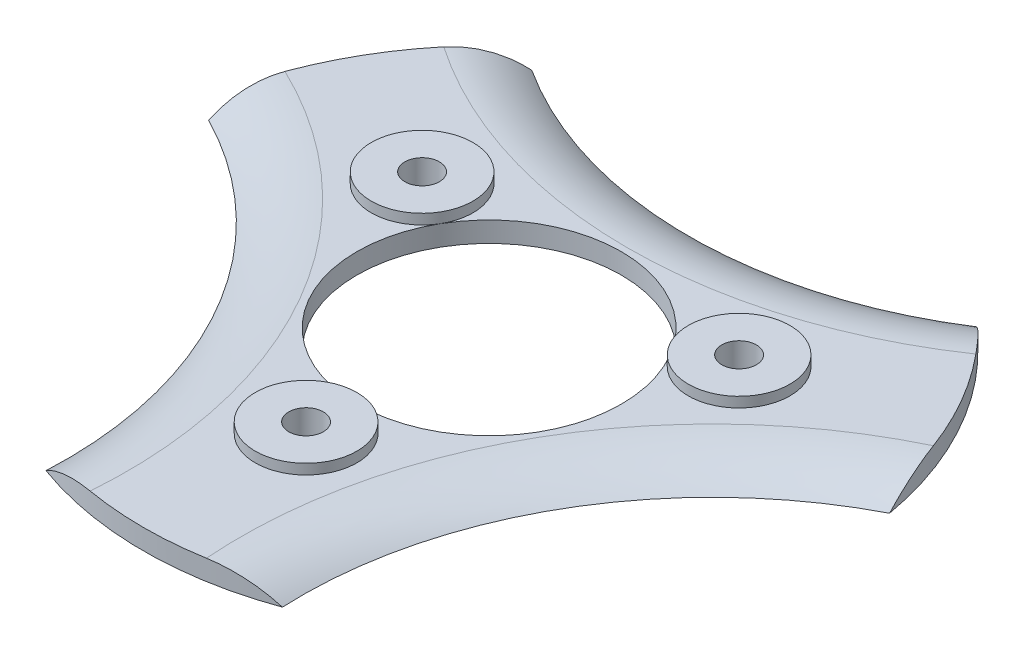
ISO-10303-21;
HEADER;
FILE_DESCRIPTION(('STEP AP214'),'2;1');
FILE_NAME('part.step','',(''),(''),'','','');
FILE_SCHEMA(('AUTOMOTIVE_DESIGN { 1 0 10303 214 1 1 1 1 }'));
ENDSEC;
DATA;
#1=APPLICATION_CONTEXT('core data for automotive mechanical design processes');
#2=APPLICATION_PROTOCOL_DEFINITION('international standard','automotive_design',2000,#1);
#3=PRODUCT_CONTEXT('',#1,'mechanical');
#4=PRODUCT('Part','Part','',(#3));
#5=PRODUCT_RELATED_PRODUCT_CATEGORY('part','',(#4));
#6=PRODUCT_DEFINITION_FORMATION('','',#4);
#7=PRODUCT_DEFINITION_CONTEXT('part definition',#1,'design');
#8=PRODUCT_DEFINITION('design','',#6,#7);
#9=PRODUCT_DEFINITION_SHAPE('','',#8);
#10=(LENGTH_UNIT() NAMED_UNIT(*) SI_UNIT(.MILLI.,.METRE.));
#11=(NAMED_UNIT(*) PLANE_ANGLE_UNIT() SI_UNIT($,.RADIAN.));
#12=(NAMED_UNIT(*) SI_UNIT($,.STERADIAN.) SOLID_ANGLE_UNIT());
#13=UNCERTAINTY_MEASURE_WITH_UNIT(LENGTH_MEASURE(1.E-05),#10,'distance_accuracy_value','');
#14=(GEOMETRIC_REPRESENTATION_CONTEXT(3) GLOBAL_UNCERTAINTY_ASSIGNED_CONTEXT((#13)) GLOBAL_UNIT_ASSIGNED_CONTEXT((#10,
#11,#12)) REPRESENTATION_CONTEXT('',''));
#15=CARTESIAN_POINT('',(0.,0.,0.));
#16=DIRECTION('',(0.,0.,1.));
#17=DIRECTION('',(1.,0.,0.));
#18=AXIS2_PLACEMENT_3D('',#15,#16,#17);
#19=CARTESIAN_POINT('',(0.,2.,0.));
#20=DIRECTION('',(0.,1.,0.));
#21=DIRECTION('',(0.,0.,1.));
#22=AXIS2_PLACEMENT_3D('',#19,#20,#21);
#23=PLANE('',#22);
#24=CARTESIAN_POINT('',(0.,2.,0.));
#25=DIRECTION('',(0.,1.,0.));
#26=DIRECTION('',(0.,0.,1.));
#27=AXIS2_PLACEMENT_3D('',#24,#25,#26);
#28=CIRCLE('',#27,34.);
#29=CARTESIAN_POINT('',(31.8834478179355,2.,-11.8087152239769));
#30=VERTEX_POINT('',#29);
#31=CARTESIAN_POINT('',(26.168371278988,2.,-21.707518158579));
#32=VERTEX_POINT('',#31);
#33=EDGE_CURVE('E138',#30,#32,#28,.T.);
#34=ORIENTED_EDGE('',*,*,#33,.T.);
#35=CARTESIAN_POINT('',(5.44703171456717E-13,2.,-60.));
#36=DIRECTION('',(0.,1.,0.));
#37=DIRECTION('',(0.,0.,1.));
#38=AXIS2_PLACEMENT_3D('',#35,#36,#37);
#39=CIRCLE('',#38,46.37992907466);
#40=CARTESIAN_POINT('',(-26.1683712789876,2.,-21.7075181585795));
#41=VERTEX_POINT('',#40);
#42=EDGE_CURVE('E66',#32,#41,#39,.F.);
#43=ORIENTED_EDGE('',*,*,#42,.T.);
#44=CARTESIAN_POINT('',(-31.8834478179355,2.,-11.808715223977));
#45=VERTEX_POINT('',#44);
#46=EDGE_CURVE('E136',#41,#45,#28,.T.);
#47=ORIENTED_EDGE('',*,*,#46,.T.);
#48=CARTESIAN_POINT('',(-51.9615242270665,2.,29.9999999999998));
#49=DIRECTION('',(0.,1.,0.));
#50=DIRECTION('',(0.,0.,1.));
#51=AXIS2_PLACEMENT_3D('',#48,#49,#50);
#52=CIRCLE('',#51,46.37992907466);
#53=CARTESIAN_POINT('',(-5.71507653894791,2.,33.5162333825561));
#54=VERTEX_POINT('',#53);
#55=EDGE_CURVE('E197',#45,#54,#52,.F.);
#56=ORIENTED_EDGE('',*,*,#55,.T.);
#57=CARTESIAN_POINT('',(5.71507653894776,2.,33.5162333825561));
#58=VERTEX_POINT('',#57);
#59=EDGE_CURVE('E132',#54,#58,#28,.T.);
#60=ORIENTED_EDGE('',*,*,#59,.T.);
#61=CARTESIAN_POINT('',(51.9615242270663,2.,30.));
#62=DIRECTION('',(0.,1.,0.));
#63=DIRECTION('',(0.,0.,1.));
#64=AXIS2_PLACEMENT_3D('',#61,#62,#63);
#65=CIRCLE('',#64,46.37992907466);
#66=EDGE_CURVE('E113',#58,#30,#65,.F.);
#67=ORIENTED_EDGE('',*,*,#66,.T.);
#68=EDGE_LOOP('',(#34,#43,#47,#56,#60,#67));
#69=FACE_BOUND('',#68,.T.);
#70=CARTESIAN_POINT('',(0.,2.,0.));
#71=DIRECTION('',(0.,1.,0.));
#72=DIRECTION('',(0.,0.,1.));
#73=AXIS2_PLACEMENT_3D('',#70,#71,#72);
#74=CIRCLE('',#73,13.);
#75=CARTESIAN_POINT('',(-1.17142076009162E-13,2.,13.));
#76=VERTEX_POINT('',#75);
#77=CARTESIAN_POINT('',(11.2583302491977,2.,-6.49999999999995));
#78=VERTEX_POINT('',#77);
#79=EDGE_CURVE('E158',#76,#78,#74,.T.);
#80=ORIENTED_EDGE('',*,*,#79,.F.);
#81=CARTESIAN_POINT('',(-1.62196645003831E-13,2.,17.999991607498));
#82=DIRECTION('',(0.,1.,0.));
#83=DIRECTION('',(0.866025403784443,0.,-0.499999999999992));
#84=AXIS2_PLACEMENT_3D('',#81,#82,#83);
#85=CIRCLE('',#84,5.);
#86=EDGE_CURVE('E234',#76,#76,#85,.T.);
#87=ORIENTED_EDGE('',*,*,#86,.F.);
#88=CARTESIAN_POINT('',(-11.2583229810778,2.,-6.49999580374901));
#89=VERTEX_POINT('',#88);
#90=EDGE_CURVE('E217',#89,#76,#74,.T.);
#91=ORIENTED_EDGE('',*,*,#90,.F.);
#92=CARTESIAN_POINT('',(-15.58845,2.,-8.99999580374901));
#93=DIRECTION('',(0.,1.,0.));
#94=DIRECTION('',(0.,0.,1.));
#95=AXIS2_PLACEMENT_3D('',#92,#93,#94);
#96=CIRCLE('',#95,5.);
#97=EDGE_CURVE('E210',#89,#89,#96,.T.);
#98=ORIENTED_EDGE('',*,*,#97,.F.);
#99=EDGE_CURVE('E207',#78,#89,#74,.T.);
#100=ORIENTED_EDGE('',*,*,#99,.F.);
#101=CARTESIAN_POINT('',(15.58845,2.,-8.99999580374895));
#102=DIRECTION('',(0.,1.,0.));
#103=DIRECTION('',(-0.866025403784436,0.,-0.500000000000004));
#104=AXIS2_PLACEMENT_3D('',#101,#102,#103);
#105=CIRCLE('',#104,5.);
#106=EDGE_CURVE('E220',#78,#78,#105,.T.);
#107=ORIENTED_EDGE('',*,*,#106,.F.);
#108=EDGE_LOOP('',(#80,#87,#91,#98,#100,#107));
#109=FACE_BOUND('',#108,.T.);
#110=ADVANCED_FACE('F38',(#69,#109),#23,.T.);
#111=CARTESIAN_POINT('',(0.,2.,0.));
#112=DIRECTION('',(0.,-1.,0.));
#113=DIRECTION('',(0.,0.,-1.));
#114=AXIS2_PLACEMENT_3D('',#111,#112,#113);
#115=CYLINDRICAL_SURFACE('',#114,34.);
#116=ORIENTED_EDGE('',*,*,#46,.F.);
#117=CARTESIAN_POINT('',(-26.1683712789876,2.,-21.7075181585795));
#118=CARTESIAN_POINT('',(-25.9855270764145,2.00004130304708,-21.9279943079052));
#119=CARTESIAN_POINT('',(-25.7998595180002,1.98780212207409,-22.1460914579261));
#120=CARTESIAN_POINT('',(-25.4245270350654,1.93925790771543,-22.5759637575963));
#121=CARTESIAN_POINT('',(-25.2348633954354,1.90296049898237,-22.7877408880027));
#122=CARTESIAN_POINT('',(-24.8580319053838,1.80804409624142,-23.198146988304));
#123=CARTESIAN_POINT('',(-24.6709273135421,1.75002979170822,-23.3969746305963));
#124=CARTESIAN_POINT('',(-24.2959126585912,1.61231560168584,-23.7861641283764));
#125=CARTESIAN_POINT('',(-24.1080026191755,1.53261634984223,-23.9765262310426));
#126=CARTESIAN_POINT('',(-23.745698908433,1.35846597696961,-24.3352069978632));
#127=CARTESIAN_POINT('',(-23.5712552915652,1.26538708925383,-24.5041442946914));
#128=CARTESIAN_POINT('',(-23.2242702680254,1.06180143302202,-24.8332531600146));
#129=CARTESIAN_POINT('',(-23.0517289314906,0.951294024198379,-24.9934244061618));
#130=CARTESIAN_POINT('',(-22.7055403539784,0.710645503192991,-25.3083880694313));
#131=CARTESIAN_POINT('',(-22.5319731336187,0.580082934869169,-25.462946211658));
#132=CARTESIAN_POINT('',(-22.189527740197,0.302313453526672,-25.7619243059814));
#133=CARTESIAN_POINT('',(-22.0206490785681,0.155108282905113,-25.9063453168236));
#134=CARTESIAN_POINT('',(-21.8547787293421,0.,-26.0455110660455));
#135=B_SPLINE_CURVE_WITH_KNOTS('',3,(#117,#118,#119,#120,#121,#122,#123,#124,#125,#126,#127,
#128,#129,#130,#131,#132,#133,#134),.UNSPECIFIED.,.F.,.F.,(4,2,2,2,2,2,2,2,4),(0.,
0.858962445971918,1.71765279539769,2.55402460160269,3.39037197120738,4.16982886817323,
4.9493144083322,5.74826944816565,6.54714091873224),.UNSPECIFIED.);
#136=CARTESIAN_POINT('',(-21.8547787293421,0.,-26.0455110660455));
#137=VERTEX_POINT('',#136);
#138=EDGE_CURVE('E187',#41,#137,#135,.T.);
#139=ORIENTED_EDGE('',*,*,#138,.T.);
#140=CARTESIAN_POINT('',(0.,0.,0.));
#141=DIRECTION('',(0.,1.,0.));
#142=DIRECTION('',(0.,0.,1.));
#143=AXIS2_PLACEMENT_3D('',#140,#141,#142);
#144=CIRCLE('',#143,34.);
#145=CARTESIAN_POINT('',(-33.4834636024151,0.,-5.90403804067578));
#146=VERTEX_POINT('',#145);
#147=EDGE_CURVE('E126',#137,#146,#144,.T.);
#148=ORIENTED_EDGE('',*,*,#147,.T.);
#149=CARTESIAN_POINT('',(-33.4834636024151,0.,-5.90403804067578));
#150=CARTESIAN_POINT('',(-33.4421211189233,0.170636400555607,-6.13860985414907));
#151=CARTESIAN_POINT('',(-33.3970825332415,0.331707596778924,-6.37952219244287));
#152=CARTESIAN_POINT('',(-33.2991674705957,0.633637685164363,-6.87227901463234));
#153=CARTESIAN_POINT('',(-33.2462885454918,0.774490236936123,-7.12412689571063));
#154=CARTESIAN_POINT('',(-33.1338007449697,1.0313037885543,-7.62998408071805));
#155=CARTESIAN_POINT('',(-33.0744102923203,1.14783086171311,-7.88375443973064));
#156=CARTESIAN_POINT('',(-32.9475817194198,1.35960438531279,-8.39803203544944));
#157=CARTESIAN_POINT('',(-32.8801452409498,1.45485516579955,-8.65853788931793));
#158=CARTESIAN_POINT('',(-32.745088622828,1.6138255651562,-9.1552093880058));
#159=CARTESIAN_POINT('',(-32.6783209364399,1.6798723672837,-9.39086449041932));
#160=CARTESIAN_POINT('',(-32.5384361721845,1.79387790500784,-9.86464361071126));
#161=CARTESIAN_POINT('',(-32.4653195982877,1.84183807469764,-10.1027674313055));
#162=CARTESIAN_POINT('',(-32.3110643500256,1.92013742650618,-10.5858795437595));
#163=CARTESIAN_POINT('',(-32.2297736542944,1.95001894127885,-10.8308937586562));
#164=CARTESIAN_POINT('',(-32.0610873366909,1.98996739307241,-11.3205213957135));
#165=CARTESIAN_POINT('',(-31.9736897445299,2.00002790432592,-11.5651346622203));
#166=CARTESIAN_POINT('',(-31.8834478179355,2.,-11.808715223977));
#167=B_SPLINE_CURVE_WITH_KNOTS('',3,(#149,#150,#151,#152,#153,#154,#155,#156,#157,#158,#159,
#160,#161,#162,#163,#164,#165,#166),.UNSPECIFIED.,.F.,.F.,(4,2,2,2,2,2,2,2,4),(0.,
0.878802858535029,1.7578807027269,2.61339187664674,3.46872878220768,4.22905660005117,
4.98932411864874,5.76811023265486,6.54714877966706),.UNSPECIFIED.);
#168=EDGE_CURVE('E59',#146,#45,#167,.T.);
#169=ORIENTED_EDGE('',*,*,#168,.T.);
#170=EDGE_LOOP('',(#116,#139,#148,#169));
#171=FACE_BOUND('',#170,.T.);
#172=ADVANCED_FACE('F172',(#171),#115,.T.);
#173=CARTESIAN_POINT('',(33.4834636024151,0.,-5.90403804067564));
#174=VERTEX_POINT('',#173);
#175=CARTESIAN_POINT('',(21.8547787293426,0.,-26.0455110660451));
#176=VERTEX_POINT('',#175);
#177=EDGE_CURVE('E123',#174,#176,#144,.T.);
#178=ORIENTED_EDGE('',*,*,#177,.T.);
#179=CARTESIAN_POINT('',(21.8547787293426,0.,-26.0455110660451));
#180=CARTESIAN_POINT('',(22.0372526370763,0.170636400555606,-25.892421518349));
#181=CARTESIAN_POINT('',(22.223369549283,0.331707596778921,-25.7329607898511));
#182=CARTESIAN_POINT('',(22.6011519438643,0.633637685164359,-25.401785447092));
#183=CARTESIAN_POINT('',(22.7928191442154,0.77449023693612,-25.2300670140881));
#184=CARTESIAN_POINT('',(23.1746604168577,1.0313037885543,-24.8797211287164));
#185=CARTESIAN_POINT('',(23.3647367681654,1.14783086171311,-24.7014023084735));
#186=CARTESIAN_POINT('',(23.7466999442048,1.35960438531279,-24.3344267445565));
#187=CARTESIAN_POINT('',(23.9385863922545,1.45485516579955,-24.1457721141255));
#188=CARTESIAN_POINT('',(24.3011882183929,1.6138255651562,-23.7804739025388));
#189=CARTESIAN_POINT('',(24.4718876804204,1.6798723672837,-23.604823838768));
#190=CARTESIAN_POINT('',(24.8122500522482,1.79387790500784,-23.2467905191745));
#191=CARTESIAN_POINT('',(24.9819130431806,1.84183807469763,-23.0644077984451));
#192=CARTESIAN_POINT('',(25.3231727813107,1.92013742650618,-22.689262778556));
#193=CARTESIAN_POINT('',(25.494715967834,1.95001894127885,-22.4963558635132));
#194=CARTESIAN_POINT('',(25.8344027811187,1.98996739307241,-22.105455408669));
#195=CARTESIAN_POINT('',(26.0025452879358,2.00002790432592,-21.9074602403746));
#196=CARTESIAN_POINT('',(26.168371278988,2.,-21.707518158579));
#197=B_SPLINE_CURVE_WITH_KNOTS('',3,(#179,#180,#181,#182,#183,#184,#185,#186,#187,#188,#189,
#190,#191,#192,#193,#194,#195,#196),.UNSPECIFIED.,.F.,.F.,(4,2,2,2,2,2,2,2,4),(0.,
0.87880285853503,1.7578807027269,2.61339187664675,3.46872878220769,4.22905660005118,
4.98932411864875,5.76811023265486,6.54714877966707),.UNSPECIFIED.);
#198=EDGE_CURVE('E105',#176,#32,#197,.T.);
#199=ORIENTED_EDGE('',*,*,#198,.T.);
#200=ORIENTED_EDGE('',*,*,#33,.F.);
#201=CARTESIAN_POINT('',(31.8834478179355,2.,-11.8087152239769));
#202=CARTESIAN_POINT('',(31.9829636628936,2.00004130304708,-11.540129424951));
#203=CARTESIAN_POINT('',(32.0790075560976,1.98780212207409,-11.2702880276951));
#204=CARTESIAN_POINT('',(32.2636216465278,1.93925790771543,-10.730304412773));
#205=CARTESIAN_POINT('',(32.3521942015853,1.90296049898237,-10.4601623174761));
#206=CARTESIAN_POINT('',(32.5192005652886,1.80804409624142,-9.92861362399474));
#207=CARTESIAN_POINT('',(32.5978380585674,1.75002979170822,-9.66716247314897));
#208=CARTESIAN_POINT('',(32.7473787230556,1.61231560168583,-9.14779550628001));
#209=CARTESIAN_POINT('',(32.8182821201745,1.53261634984223,-8.88987958718676));
#210=CARTESIAN_POINT('',(32.9477569207188,1.3584659769696,-8.39677498638804));
#211=CARTESIAN_POINT('',(33.0068391029848,1.26538708925383,-8.16123373423846));
#212=CARTESIAN_POINT('',(33.1183632291955,1.06180143302202,-7.69618145645862));
#213=CARTESIAN_POINT('',(33.1708049290473,0.951294024198381,-7.46667065274296));
#214=CARTESIAN_POINT('',(33.2704771739517,0.710645503192995,-7.00938071848261));
#215=CARTESIAN_POINT('',(33.3175448413018,0.580082934869172,-6.78178802527353));
#216=CARTESIAN_POINT('',(33.4052447694501,0.302313453526674,-6.33573256799975));
#217=CARTESIAN_POINT('',(33.4458777028653,0.155108282905114,-6.11726885145086));
#218=CARTESIAN_POINT('',(33.4834636024151,0.,-5.90403804067564));
#219=B_SPLINE_CURVE_WITH_KNOTS('',3,(#201,#202,#203,#204,#205,#206,#207,#208,#209,#210,#211,
#212,#213,#214,#215,#216,#217,#218),.UNSPECIFIED.,.F.,.F.,(4,2,2,2,2,2,2,2,4),(0.,
0.858962445971919,1.7176527953977,2.55402460160269,3.39037197120738,4.16982886817323,
4.9493144083322,5.74826944816564,6.54714091873223),.UNSPECIFIED.);
#220=EDGE_CURVE('E114',#30,#174,#219,.T.);
#221=ORIENTED_EDGE('',*,*,#220,.T.);
#222=EDGE_LOOP('',(#178,#199,#200,#221));
#223=FACE_BOUND('',#222,.T.);
#224=ADVANCED_FACE('F130',(#223),#115,.T.);
#225=CARTESIAN_POINT('',(0.,0.,0.));
#226=DIRECTION('',(0.,1.,0.));
#227=DIRECTION('',(0.,0.,1.));
#228=AXIS2_PLACEMENT_3D('',#225,#226,#227);
#229=PLANE('',#228);
#230=CARTESIAN_POINT('',(-11.6286848730729,0.,31.9495491067208));
#231=VERTEX_POINT('',#230);
#232=CARTESIAN_POINT('',(11.6286848730727,0.,31.9495491067209));
#233=VERTEX_POINT('',#232);
#234=EDGE_CURVE('E134',#231,#233,#144,.T.);
#235=ORIENTED_EDGE('',*,*,#234,.F.);
#236=CARTESIAN_POINT('',(-51.9615242270665,0.,29.9999999999998));
#237=DIRECTION('',(0.,1.,0.));
#238=DIRECTION('',(-0.866025403784436,0.,-0.500000000000004));
#239=AXIS2_PLACEMENT_3D('',#236,#237,#238);
#240=CIRCLE('',#239,40.37992907466);
#241=EDGE_CURVE('E127',#231,#146,#240,.T.);
#242=ORIENTED_EDGE('',*,*,#241,.T.);
#243=ORIENTED_EDGE('',*,*,#147,.F.);
#244=CARTESIAN_POINT('',(5.44703171456717E-13,0.,-60.));
#245=DIRECTION('',(0.,1.,0.));
#246=DIRECTION('',(0.866025403784443,0.,-0.499999999999992));
#247=AXIS2_PLACEMENT_3D('',#244,#245,#246);
#248=CIRCLE('',#247,40.37992907466);
#249=EDGE_CURVE('E109',#137,#176,#248,.T.);
#250=ORIENTED_EDGE('',*,*,#249,.T.);
#251=ORIENTED_EDGE('',*,*,#177,.F.);
#252=CARTESIAN_POINT('',(51.9615242270663,0.,30.));
#253=DIRECTION('',(0.,1.,0.));
#254=DIRECTION('',(0.,0.,1.));
#255=AXIS2_PLACEMENT_3D('',#252,#253,#254);
#256=CIRCLE('',#255,40.37992907466);
#257=EDGE_CURVE('E202',#174,#233,#256,.T.);
#258=ORIENTED_EDGE('',*,*,#257,.T.);
#259=EDGE_LOOP('',(#235,#242,#243,#250,#251,#258));
#260=FACE_BOUND('',#259,.T.);
#261=CARTESIAN_POINT('',(0.,0.,17.999991607498));
#262=DIRECTION('',(0.,1.,0.));
#263=DIRECTION('',(0.,0.,1.));
#264=AXIS2_PLACEMENT_3D('',#261,#262,#263);
#265=CIRCLE('',#264,1.7);
#266=CARTESIAN_POINT('',(0.,0.,19.699991607498));
#267=VERTEX_POINT('',#266);
#268=EDGE_CURVE('E141',#267,#267,#265,.T.);
#269=ORIENTED_EDGE('',*,*,#268,.T.);
#270=EDGE_LOOP('',(#269));
#271=FACE_BOUND('',#270,.T.);
#272=CARTESIAN_POINT('',(15.58845,0.,-8.99999580374902));
#273=DIRECTION('',(0.,1.,0.));
#274=DIRECTION('',(0.,0.,1.));
#275=AXIS2_PLACEMENT_3D('',#272,#273,#274);
#276=CIRCLE('',#275,1.7);
#277=CARTESIAN_POINT('',(15.58845,0.,-7.29999580374902));
#278=VERTEX_POINT('',#277);
#279=EDGE_CURVE('E144',#278,#278,#276,.T.);
#280=ORIENTED_EDGE('',*,*,#279,.T.);
#281=EDGE_LOOP('',(#280));
#282=FACE_BOUND('',#281,.T.);
#283=CARTESIAN_POINT('',(-15.58845,0.,-8.99999580374901));
#284=DIRECTION('',(0.,1.,0.));
#285=DIRECTION('',(0.,0.,1.));
#286=AXIS2_PLACEMENT_3D('',#283,#284,#285);
#287=CIRCLE('',#286,1.7);
#288=CARTESIAN_POINT('',(-15.58845,0.,-7.29999580374901));
#289=VERTEX_POINT('',#288);
#290=EDGE_CURVE('E148',#289,#289,#287,.T.);
#291=ORIENTED_EDGE('',*,*,#290,.T.);
#292=EDGE_LOOP('',(#291));
#293=FACE_BOUND('',#292,.T.);
#294=CARTESIAN_POINT('',(0.,0.,0.));
#295=DIRECTION('',(0.,1.,0.));
#296=DIRECTION('',(0.,0.,1.));
#297=AXIS2_PLACEMENT_3D('',#294,#295,#296);
#298=CIRCLE('',#297,13.);
#299=CARTESIAN_POINT('',(0.,0.,13.));
#300=VERTEX_POINT('',#299);
#301=EDGE_CURVE('E203',#300,#300,#298,.T.);
#302=ORIENTED_EDGE('',*,*,#301,.T.);
#303=EDGE_LOOP('',(#302));
#304=FACE_BOUND('',#303,.T.);
#305=ADVANCED_FACE('F120',(#260,#271,#282,#293,#304),#229,.F.);
#306=ORIENTED_EDGE('',*,*,#59,.F.);
#307=CARTESIAN_POINT('',(-5.71507653894791,2.,33.5162333825561));
#308=CARTESIAN_POINT('',(-5.99743658647911,2.00004130304708,33.468123732856));
#309=CARTESIAN_POINT('',(-6.27914803809737,1.98780212207409,33.416379485621));
#310=CARTESIAN_POINT('',(-6.83909461146237,1.93925790771543,33.306268170369));
#311=CARTESIAN_POINT('',(-7.11733080614985,1.90296049898237,33.2479032054785));
#312=CARTESIAN_POINT('',(-7.66116865990472,1.80804409624142,33.1267606122985));
#313=CARTESIAN_POINT('',(-7.92691074502525,1.75002979170822,33.064137103745));
#314=CARTESIAN_POINT('',(-8.45146606446434,1.61231560168584,32.9339596346561));
#315=CARTESIAN_POINT('',(-8.71027950099896,1.53261634984223,32.8664058182291));
#316=CARTESIAN_POINT('',(-9.20205801228578,1.3584659769696,32.731981984251));
#317=CARTESIAN_POINT('',(-9.43558381141953,1.26538708925383,32.6653780289296));
#318=CARTESIAN_POINT('',(-9.89409296117002,1.06180143302202,32.529434616473));
#319=CARTESIAN_POINT('',(-10.1190759975567,0.951294024198377,32.4600950589045));
#320=CARTESIAN_POINT('',(-10.5649368199732,0.710645503192992,32.3177687879137));
#321=CARTESIAN_POINT('',(-10.7855717076831,0.58008293486917,32.2447342369313));
#322=CARTESIAN_POINT('',(-11.215717029253,0.302313453526673,32.0976568739809));
#323=CARTESIAN_POINT('',(-11.4252286242971,0.155108282905113,32.0236141682742));
#324=CARTESIAN_POINT('',(-11.6286848730729,0.,31.9495491067208));
#325=B_SPLINE_CURVE_WITH_KNOTS('',3,(#307,#308,#309,#310,#311,#312,#313,#314,#315,#316,#317,
#318,#319,#320,#321,#322,#323,#324),.UNSPECIFIED.,.F.,.F.,(4,2,2,2,2,2,2,2,4),(0.,
0.858962445971924,1.7176527953977,2.5540246016027,3.39037197120739,4.16982886817324,
4.94931440833221,5.74826944816565,6.54714091873224),.UNSPECIFIED.);
#326=EDGE_CURVE('E11',#54,#231,#325,.T.);
#327=ORIENTED_EDGE('',*,*,#326,.T.);
#328=ORIENTED_EDGE('',*,*,#234,.T.);
#329=CARTESIAN_POINT('',(11.6286848730727,0.,31.9495491067209));
#330=CARTESIAN_POINT('',(11.4048684818472,0.17063640055561,32.0310313724981));
#331=CARTESIAN_POINT('',(11.1737129839588,0.331707596778925,32.1124829822941));
#332=CARTESIAN_POINT('',(10.6980155267317,0.63363768516436,32.2740644617244));
#333=CARTESIAN_POINT('',(10.4534694012767,0.774490236936118,32.3541939097988));
#334=CARTESIAN_POINT('',(9.9591403281123,1.0313037885543,32.5097052094345));
#335=CARTESIAN_POINT('',(9.70967352415521,1.14783086171311,32.5851567482042));
#336=CARTESIAN_POINT('',(9.20088177521531,1.35960438531279,32.732458780006));
#337=CARTESIAN_POINT('',(8.94155884869565,1.45485516579955,32.8043100034435));
#338=CARTESIAN_POINT('',(8.44390040443535,1.6138255651562,32.9356832905447));
#339=CARTESIAN_POINT('',(8.20643325601975,1.6798723672837,32.9956883291875));
#340=CARTESIAN_POINT('',(7.72618611993659,1.79387790500784,33.1114341298858));
#341=CARTESIAN_POINT('',(7.48340655510743,1.84183807469764,33.1671752297507));
#342=CARTESIAN_POINT('',(6.98789156871517,1.92013742650618,33.2751423223156));
#343=CARTESIAN_POINT('',(6.73505768646074,1.95001894127885,33.3272496221695));
#344=CARTESIAN_POINT('',(6.22668455557242,1.98996739307241,33.4259768043826));
#345=CARTESIAN_POINT('',(5.97114445659439,2.00002790432592,33.472594902595));
#346=CARTESIAN_POINT('',(5.71507653894776,2.,33.5162333825561));
#347=B_SPLINE_CURVE_WITH_KNOTS('',3,(#329,#330,#331,#332,#333,#334,#335,#336,#337,#338,#339,
#340,#341,#342,#343,#344,#345,#346),.UNSPECIFIED.,.F.,.F.,(4,2,2,2,2,2,2,2,4),(0.,
0.87880285853503,1.7578807027269,2.61339187664674,3.46872878220768,4.22905660005117,
4.98932411864874,5.76811023265486,6.54714877966707),.UNSPECIFIED.);
#348=EDGE_CURVE('E52',#233,#58,#347,.T.);
#349=ORIENTED_EDGE('',*,*,#348,.T.);
#350=EDGE_LOOP('',(#306,#327,#328,#349));
#351=FACE_BOUND('',#350,.T.);
#352=ADVANCED_FACE('F167',(#351),#115,.T.);
#353=CARTESIAN_POINT('',(0.,2.,17.999991607498));
#354=DIRECTION('',(0.,-1.,0.));
#355=DIRECTION('',(0.,0.,-1.));
#356=AXIS2_PLACEMENT_3D('',#353,#354,#355);
#357=CYLINDRICAL_SURFACE('',#356,1.7);
#358=ORIENTED_EDGE('',*,*,#268,.F.);
#359=EDGE_LOOP('',(#358));
#360=FACE_BOUND('',#359,.T.);
#361=CARTESIAN_POINT('',(-1.62196645003831E-13,3.,17.999991607498));
#362=DIRECTION('',(0.,1.,0.));
#363=DIRECTION('',(0.866025403784443,0.,-0.499999999999992));
#364=AXIS2_PLACEMENT_3D('',#361,#362,#363);
#365=CIRCLE('',#364,1.7);
#366=CARTESIAN_POINT('',(1.47224318643339,3.,17.149991607498));
#367=VERTEX_POINT('',#366);
#368=EDGE_CURVE('E308',#367,#367,#365,.T.);
#369=ORIENTED_EDGE('',*,*,#368,.T.);
#370=EDGE_LOOP('',(#369));
#371=FACE_BOUND('',#370,.T.);
#372=ADVANCED_FACE('F171',(#360,#371),#357,.F.);
#373=CARTESIAN_POINT('',(15.58845,2.,-8.99999580374902));
#374=DIRECTION('',(0.,-1.,0.));
#375=DIRECTION('',(0.,0.,-1.));
#376=AXIS2_PLACEMENT_3D('',#373,#374,#375);
#377=CYLINDRICAL_SURFACE('',#376,1.7);
#378=ORIENTED_EDGE('',*,*,#279,.F.);
#379=EDGE_LOOP('',(#378));
#380=FACE_BOUND('',#379,.T.);
#381=CARTESIAN_POINT('',(15.58845,3.,-8.99999580374895));
#382=DIRECTION('',(0.,1.,0.));
#383=DIRECTION('',(-0.866025403784436,0.,-0.500000000000004));
#384=AXIS2_PLACEMENT_3D('',#381,#382,#383);
#385=CIRCLE('',#384,1.7);
#386=CARTESIAN_POINT('',(14.1162068135665,3.,-9.84999580374896));
#387=VERTEX_POINT('',#386);
#388=EDGE_CURVE('E222',#387,#387,#385,.T.);
#389=ORIENTED_EDGE('',*,*,#388,.T.);
#390=EDGE_LOOP('',(#389));
#391=FACE_BOUND('',#390,.T.);
#392=ADVANCED_FACE('F273',(#380,#391),#377,.F.);
#393=CARTESIAN_POINT('',(-15.58845,2.,-8.99999580374901));
#394=DIRECTION('',(0.,-1.,0.));
#395=DIRECTION('',(0.,0.,-1.));
#396=AXIS2_PLACEMENT_3D('',#393,#394,#395);
#397=CYLINDRICAL_SURFACE('',#396,1.7);
#398=ORIENTED_EDGE('',*,*,#290,.F.);
#399=EDGE_LOOP('',(#398));
#400=FACE_BOUND('',#399,.T.);
#401=CARTESIAN_POINT('',(-15.58845,3.,-8.99999580374901));
#402=DIRECTION('',(0.,1.,0.));
#403=DIRECTION('',(0.,0.,1.));
#404=AXIS2_PLACEMENT_3D('',#401,#402,#403);
#405=CIRCLE('',#404,1.7);
#406=CARTESIAN_POINT('',(-15.58845,3.,-7.29999580374901));
#407=VERTEX_POINT('',#406);
#408=EDGE_CURVE('E240',#407,#407,#405,.T.);
#409=ORIENTED_EDGE('',*,*,#408,.T.);
#410=EDGE_LOOP('',(#409));
#411=FACE_BOUND('',#410,.T.);
#412=ADVANCED_FACE('F258',(#400,#411),#397,.F.);
#413=CARTESIAN_POINT('',(0.,2.,0.));
#414=DIRECTION('',(0.,-1.,0.));
#415=DIRECTION('',(0.,0.,-1.));
#416=AXIS2_PLACEMENT_3D('',#413,#414,#415);
#417=CYLINDRICAL_SURFACE('',#416,13.);
#418=ORIENTED_EDGE('',*,*,#90,.T.);
#419=ORIENTED_EDGE('',*,*,#79,.T.);
#420=ORIENTED_EDGE('',*,*,#99,.T.);
#421=EDGE_LOOP('',(#418,#419,#420));
#422=FACE_BOUND('',#421,.T.);
#423=ORIENTED_EDGE('',*,*,#301,.F.);
#424=EDGE_LOOP('',(#423));
#425=FACE_BOUND('',#424,.T.);
#426=ADVANCED_FACE('F254',(#422,#425),#417,.F.);
#427=CARTESIAN_POINT('',(-15.58845,3.,-8.99999580374901));
#428=DIRECTION('',(0.,1.,0.));
#429=DIRECTION('',(0.,0.,1.));
#430=AXIS2_PLACEMENT_3D('',#427,#428,#429);
#431=PLANE('',#430);
#432=CARTESIAN_POINT('',(-15.58845,3.,-8.99999580374901));
#433=DIRECTION('',(0.,1.,0.));
#434=DIRECTION('',(0.,0.,1.));
#435=AXIS2_PLACEMENT_3D('',#432,#433,#434);
#436=CIRCLE('',#435,5.);
#437=CARTESIAN_POINT('',(-15.58845,3.,-3.99999580374901));
#438=VERTEX_POINT('',#437);
#439=EDGE_CURVE('E204',#438,#438,#436,.T.);
#440=ORIENTED_EDGE('',*,*,#439,.T.);
#441=EDGE_LOOP('',(#440));
#442=FACE_BOUND('',#441,.T.);
#443=ORIENTED_EDGE('',*,*,#408,.F.);
#444=EDGE_LOOP('',(#443));
#445=FACE_BOUND('',#444,.T.);
#446=ADVANCED_FACE('F257',(#442,#445),#431,.T.);
#447=CARTESIAN_POINT('',(-15.58845,3.,-8.99999580374901));
#448=DIRECTION('',(0.,-1.,0.));
#449=DIRECTION('',(0.,0.,-1.));
#450=AXIS2_PLACEMENT_3D('',#447,#448,#449);
#451=CYLINDRICAL_SURFACE('',#450,5.);
#452=ORIENTED_EDGE('',*,*,#439,.F.);
#453=EDGE_LOOP('',(#452));
#454=FACE_BOUND('',#453,.T.);
#455=ORIENTED_EDGE('',*,*,#97,.T.);
#456=EDGE_LOOP('',(#455));
#457=FACE_BOUND('',#456,.T.);
#458=ADVANCED_FACE('F248',(#454,#457),#451,.T.);
#459=CARTESIAN_POINT('',(15.58845,3.,-8.99999580374895));
#460=DIRECTION('',(0.,1.,0.));
#461=DIRECTION('',(-0.866025403784436,0.,-0.500000000000004));
#462=AXIS2_PLACEMENT_3D('',#459,#460,#461);
#463=PLANE('',#462);
#464=CARTESIAN_POINT('',(15.58845,3.,-8.99999580374895));
#465=DIRECTION('',(0.,1.,0.));
#466=DIRECTION('',(-0.866025403784436,0.,-0.500000000000004));
#467=AXIS2_PLACEMENT_3D('',#464,#465,#466);
#468=CIRCLE('',#467,5.);
#469=CARTESIAN_POINT('',(11.2583229810778,3.,-11.499995803749));
#470=VERTEX_POINT('',#469);
#471=EDGE_CURVE('E128',#470,#470,#468,.T.);
#472=ORIENTED_EDGE('',*,*,#471,.T.);
#473=EDGE_LOOP('',(#472));
#474=FACE_BOUND('',#473,.T.);
#475=ORIENTED_EDGE('',*,*,#388,.F.);
#476=EDGE_LOOP('',(#475));
#477=FACE_BOUND('',#476,.T.);
#478=ADVANCED_FACE('F283',(#474,#477),#463,.T.);
#479=CARTESIAN_POINT('',(15.58845,3.,-8.99999580374895));
#480=DIRECTION('',(0.,-1.,0.));
#481=DIRECTION('',(0.,0.,-1.));
#482=AXIS2_PLACEMENT_3D('',#479,#480,#481);
#483=CYLINDRICAL_SURFACE('',#482,5.);
#484=ORIENTED_EDGE('',*,*,#471,.F.);
#485=EDGE_LOOP('',(#484));
#486=FACE_BOUND('',#485,.T.);
#487=ORIENTED_EDGE('',*,*,#106,.T.);
#488=EDGE_LOOP('',(#487));
#489=FACE_BOUND('',#488,.T.);
#490=ADVANCED_FACE('F288',(#486,#489),#483,.T.);
#491=CARTESIAN_POINT('',(-1.62196645003831E-13,3.,17.999991607498));
#492=DIRECTION('',(0.,1.,0.));
#493=DIRECTION('',(0.866025403784443,0.,-0.499999999999992));
#494=AXIS2_PLACEMENT_3D('',#491,#492,#493);
#495=PLANE('',#494);
#496=CARTESIAN_POINT('',(-1.62196645003831E-13,3.,17.999991607498));
#497=DIRECTION('',(0.,1.,0.));
#498=DIRECTION('',(0.866025403784443,0.,-0.499999999999992));
#499=AXIS2_PLACEMENT_3D('',#496,#497,#498);
#500=CIRCLE('',#499,5.);
#501=CARTESIAN_POINT('',(4.33012701892206,3.,15.4999916074981));
#502=VERTEX_POINT('',#501);
#503=EDGE_CURVE('E229',#502,#502,#500,.T.);
#504=ORIENTED_EDGE('',*,*,#503,.T.);
#505=EDGE_LOOP('',(#504));
#506=FACE_BOUND('',#505,.T.);
#507=ORIENTED_EDGE('',*,*,#368,.F.);
#508=EDGE_LOOP('',(#507));
#509=FACE_BOUND('',#508,.T.);
#510=ADVANCED_FACE('F291',(#506,#509),#495,.T.);
#511=CARTESIAN_POINT('',(-1.62196645003831E-13,3.,17.999991607498));
#512=DIRECTION('',(0.,-1.,0.));
#513=DIRECTION('',(0.,0.,-1.));
#514=AXIS2_PLACEMENT_3D('',#511,#512,#513);
#515=CYLINDRICAL_SURFACE('',#514,5.);
#516=ORIENTED_EDGE('',*,*,#503,.F.);
#517=EDGE_LOOP('',(#516));
#518=FACE_BOUND('',#517,.T.);
#519=ORIENTED_EDGE('',*,*,#86,.T.);
#520=EDGE_LOOP('',(#519));
#521=FACE_BOUND('',#520,.T.);
#522=ADVANCED_FACE('F296',(#518,#521),#515,.T.);
#523=CARTESIAN_POINT('',(5.44703171456717E-13,-8.,-60.));
#524=DIRECTION('',(0.,1.,0.));
#525=DIRECTION('',(0.,0.,1.));
#526=AXIS2_PLACEMENT_3D('',#523,#524,#525);
#527=TOROIDAL_SURFACE('',#526,46.37992907466,10.);
#528=ORIENTED_EDGE('',*,*,#138,.F.);
#529=ORIENTED_EDGE('',*,*,#42,.F.);
#530=ORIENTED_EDGE('',*,*,#198,.F.);
#531=ORIENTED_EDGE('',*,*,#249,.F.);
#532=EDGE_LOOP('',(#528,#529,#530,#531));
#533=FACE_BOUND('',#532,.T.);
#534=ADVANCED_FACE('F108',(#533),#527,.T.);
#535=CARTESIAN_POINT('',(-51.9615242270665,-8.,29.9999999999998));
#536=DIRECTION('',(0.,1.,0.));
#537=DIRECTION('',(0.,0.,1.));
#538=AXIS2_PLACEMENT_3D('',#535,#536,#537);
#539=TOROIDAL_SURFACE('',#538,46.37992907466,10.);
#540=ORIENTED_EDGE('',*,*,#326,.F.);
#541=ORIENTED_EDGE('',*,*,#55,.F.);
#542=ORIENTED_EDGE('',*,*,#168,.F.);
#543=ORIENTED_EDGE('',*,*,#241,.F.);
#544=EDGE_LOOP('',(#540,#541,#542,#543));
#545=FACE_BOUND('',#544,.T.);
#546=ADVANCED_FACE('F324',(#545),#539,.T.);
#547=CARTESIAN_POINT('',(51.9615242270663,-8.,30.));
#548=DIRECTION('',(0.,1.,0.));
#549=DIRECTION('',(0.,0.,1.));
#550=AXIS2_PLACEMENT_3D('',#547,#548,#549);
#551=TOROIDAL_SURFACE('',#550,46.37992907466,10.);
#552=ORIENTED_EDGE('',*,*,#220,.F.);
#553=ORIENTED_EDGE('',*,*,#66,.F.);
#554=ORIENTED_EDGE('',*,*,#348,.F.);
#555=ORIENTED_EDGE('',*,*,#257,.F.);
#556=EDGE_LOOP('',(#552,#553,#554,#555));
#557=FACE_BOUND('',#556,.T.);
#558=ADVANCED_FACE('F40',(#557),#551,.T.);
#559=CLOSED_SHELL('',(#110,#172,#224,#305,#352,#372,#392,#412,#426,#446,#458,#478,#490,#510,
#522,#534,#546,#558));
#560=MANIFOLD_SOLID_BREP('B2',#559);
#561=ADVANCED_BREP_SHAPE_REPRESENTATION('',(#18,#560),#14);
#562=SHAPE_DEFINITION_REPRESENTATION(#9,#561);
ENDSEC;
END-ISO-10303-21;
